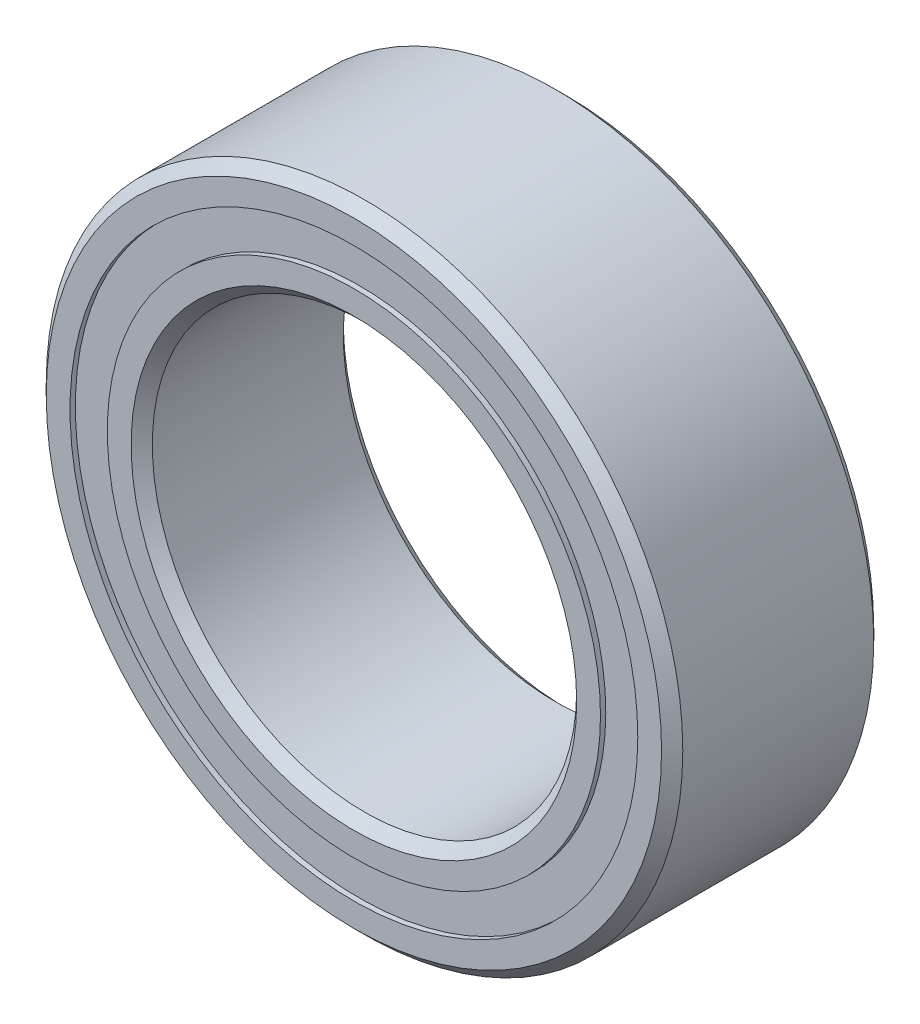
ISO-10303-21;
HEADER;
FILE_DESCRIPTION(('STEP AP214'),'2;1');
FILE_NAME('part.step','',(''),(''),'','','');
FILE_SCHEMA(('AUTOMOTIVE_DESIGN { 1 0 10303 214 1 1 1 1 }'));
ENDSEC;
DATA;
#1=APPLICATION_CONTEXT('core data for automotive mechanical design processes');
#2=APPLICATION_PROTOCOL_DEFINITION('international standard','automotive_design',2000,#1);
#3=PRODUCT_CONTEXT('',#1,'mechanical');
#4=PRODUCT('Part','Part','',(#3));
#5=PRODUCT_RELATED_PRODUCT_CATEGORY('part','',(#4));
#6=PRODUCT_DEFINITION_FORMATION('','',#4);
#7=PRODUCT_DEFINITION_CONTEXT('part definition',#1,'design');
#8=PRODUCT_DEFINITION('design','',#6,#7);
#9=PRODUCT_DEFINITION_SHAPE('','',#8);
#10=(LENGTH_UNIT() NAMED_UNIT(*) SI_UNIT(.MILLI.,.METRE.));
#11=(NAMED_UNIT(*) PLANE_ANGLE_UNIT() SI_UNIT($,.RADIAN.));
#12=(NAMED_UNIT(*) SI_UNIT($,.STERADIAN.) SOLID_ANGLE_UNIT());
#13=UNCERTAINTY_MEASURE_WITH_UNIT(LENGTH_MEASURE(1.E-05),#10,'distance_accuracy_value','');
#14=(GEOMETRIC_REPRESENTATION_CONTEXT(3) GLOBAL_UNCERTAINTY_ASSIGNED_CONTEXT((#13)) GLOBAL_UNIT_ASSIGNED_CONTEXT((#10,
#11,#12)) REPRESENTATION_CONTEXT('',''));
#15=CARTESIAN_POINT('',(0.,0.,0.));
#16=DIRECTION('',(0.,0.,1.));
#17=DIRECTION('',(1.,0.,0.));
#18=AXIS2_PLACEMENT_3D('',#15,#16,#17);
#19=CARTESIAN_POINT('',(1.984375,3.43703832126949,0.));
#20=DIRECTION('',(0.500000000000001,0.866025403784438,0.));
#21=DIRECTION('',(0.,0.,-1.));
#22=AXIS2_PLACEMENT_3D('',#19,#20,#21);
#23=SPHERICAL_SURFACE('',#22,0.758760243513404);
#24=CARTESIAN_POINT('',(2.36375512175671,4.09414396753376,0.));
#25=VERTEX_POINT('',#24);
#26=VERTEX_LOOP('',#25);
#27=FACE_BOUND('',#26,.T.);
#28=CARTESIAN_POINT('',(1.6049948782433,2.77993267500521,0.));
#29=VERTEX_POINT('',#28);
#30=VERTEX_LOOP('',#29);
#31=FACE_BOUND('',#30,.T.);
#32=ADVANCED_FACE('P0_F16',(#27,#31),#23,.T.);
#33=CLOSED_SHELL('',(#32));
#34=MANIFOLD_SOLID_BREP('P0_B1',#33);
#35=CARTESIAN_POINT('',(-3.96875,0.,0.));
#36=DIRECTION('',(-1.,0.,0.));
#37=DIRECTION('',(0.,0.,-1.));
#38=AXIS2_PLACEMENT_3D('',#35,#36,#37);
#39=SPHERICAL_SURFACE('',#38,0.758760243513404);
#40=CARTESIAN_POINT('',(-4.7275102435134,0.,0.));
#41=VERTEX_POINT('',#40);
#42=VERTEX_LOOP('',#41);
#43=FACE_BOUND('',#42,.T.);
#44=CARTESIAN_POINT('',(-3.2099897564866,0.,0.));
#45=VERTEX_POINT('',#44);
#46=VERTEX_LOOP('',#45);
#47=FACE_BOUND('',#46,.T.);
#48=ADVANCED_FACE('P1_F16',(#43,#47),#39,.T.);
#49=CLOSED_SHELL('',(#48));
#50=MANIFOLD_SOLID_BREP('P1_B1',#49);
#51=CARTESIAN_POINT('',(0.,0.,0.));
#52=DIRECTION('',(0.,0.,1.));
#53=DIRECTION('',(1.,0.,0.));
#54=AXIS2_PLACEMENT_3D('',#51,#52,#53);
#55=TOROIDAL_SURFACE('',#54,3.96875,0.758760243513403);
#56=CARTESIAN_POINT('',(0.,0.,0.705555555555556));
#57=DIRECTION('',(0.,0.,1.));
#58=DIRECTION('',(1.,0.,0.));
#59=AXIS2_PLACEMENT_3D('',#56,#57,#58);
#60=CIRCLE('',#59,3.68962912087912);
#61=CARTESIAN_POINT('',(3.68962912087912,0.,0.705555555555556));
#62=VERTEX_POINT('',#61);
#63=EDGE_CURVE('P2_E33',#62,#62,#60,.T.);
#64=ORIENTED_EDGE('',*,*,#63,.F.);
#65=EDGE_LOOP('',(#64));
#66=FACE_BOUND('',#65,.T.);
#67=CARTESIAN_POINT('',(0.,0.,-0.705555555555556));
#68=DIRECTION('',(0.,0.,1.));
#69=DIRECTION('',(1.,0.,0.));
#70=AXIS2_PLACEMENT_3D('',#67,#68,#69);
#71=CIRCLE('',#70,3.68962912087912);
#72=CARTESIAN_POINT('',(3.68962912087912,0.,-0.705555555555556));
#73=VERTEX_POINT('',#72);
#74=EDGE_CURVE('P2_E31',#73,#73,#71,.F.);
#75=ORIENTED_EDGE('',*,*,#74,.F.);
#76=EDGE_LOOP('',(#75));
#77=FACE_BOUND('',#76,.T.);
#78=ADVANCED_FACE('P2_F15',(#66,#77),#55,.F.);
#79=CARTESIAN_POINT('',(0.,0.,1.5875));
#80=DIRECTION('',(0.,0.,1.));
#81=DIRECTION('',(1.,0.,0.));
#82=AXIS2_PLACEMENT_3D('',#79,#80,#81);
#83=CYLINDRICAL_SURFACE('',#82,3.68962912087912);
#84=CARTESIAN_POINT('',(0.,0.,1.5875));
#85=DIRECTION('',(0.,0.,1.));
#86=DIRECTION('',(1.,0.,0.));
#87=AXIS2_PLACEMENT_3D('',#84,#85,#86);
#88=CIRCLE('',#87,3.68962912087912);
#89=CARTESIAN_POINT('',(3.68962912087912,0.,1.5875));
#90=VERTEX_POINT('',#89);
#91=EDGE_CURVE('P2_E19',#90,#90,#88,.F.);
#92=ORIENTED_EDGE('',*,*,#91,.T.);
#93=EDGE_LOOP('',(#92));
#94=FACE_BOUND('',#93,.T.);
#95=ORIENTED_EDGE('',*,*,#63,.T.);
#96=EDGE_LOOP('',(#95));
#97=FACE_BOUND('',#96,.T.);
#98=ADVANCED_FACE('P2_F49',(#94,#97),#83,.T.);
#99=CARTESIAN_POINT('',(0.,0.,1.5875));
#100=DIRECTION('',(0.,0.,1.));
#101=DIRECTION('',(1.,0.,0.));
#102=AXIS2_PLACEMENT_3D('',#99,#100,#101);
#103=CYLINDRICAL_SURFACE('',#102,3.68962912087912);
#104=ORIENTED_EDGE('',*,*,#74,.T.);
#105=EDGE_LOOP('',(#104));
#106=FACE_BOUND('',#105,.T.);
#107=CARTESIAN_POINT('',(0.,0.,-1.5875));
#108=DIRECTION('',(0.,0.,1.));
#109=DIRECTION('',(1.,0.,0.));
#110=AXIS2_PLACEMENT_3D('',#107,#108,#109);
#111=CIRCLE('',#110,3.68962912087912);
#112=CARTESIAN_POINT('',(3.68962912087912,0.,-1.5875));
#113=VERTEX_POINT('',#112);
#114=EDGE_CURVE('P2_E42',#113,#113,#111,.T.);
#115=ORIENTED_EDGE('',*,*,#114,.T.);
#116=EDGE_LOOP('',(#115));
#117=FACE_BOUND('',#116,.T.);
#118=ADVANCED_FACE('P2_F56',(#106,#117),#103,.T.);
#119=CARTESIAN_POINT('',(0.,3.68962912087912,1.5875));
#120=DIRECTION('',(0.,0.,-1.));
#121=DIRECTION('',(-1.,0.,0.));
#122=AXIS2_PLACEMENT_3D('',#119,#120,#121);
#123=PLANE('',#122);
#124=ORIENTED_EDGE('',*,*,#91,.F.);
#125=EDGE_LOOP('',(#124));
#126=FACE_BOUND('',#125,.T.);
#127=CARTESIAN_POINT('',(0.,0.,1.58749999997099));
#128=DIRECTION('',(0.,0.,1.));
#129=DIRECTION('',(1.,0.,0.));
#130=AXIS2_PLACEMENT_3D('',#127,#128,#129);
#131=CIRCLE('',#130,3.33374999996749);
#132=CARTESIAN_POINT('',(3.33374999996749,0.,1.58749999997099));
#133=VERTEX_POINT('',#132);
#134=EDGE_CURVE('P2_E40',#133,#133,#131,.F.);
#135=ORIENTED_EDGE('',*,*,#134,.T.);
#136=EDGE_LOOP('',(#135));
#137=FACE_BOUND('',#136,.T.);
#138=ADVANCED_FACE('P2_F52',(#126,#137),#123,.F.);
#139=CARTESIAN_POINT('',(0.,3.33375,-1.5875));
#140=DIRECTION('',(0.,0.,1.));
#141=DIRECTION('',(1.,0.,0.));
#142=AXIS2_PLACEMENT_3D('',#139,#140,#141);
#143=PLANE('',#142);
#144=CARTESIAN_POINT('',(0.,0.,-1.58749999997099));
#145=DIRECTION('',(0.,0.,-1.));
#146=DIRECTION('',(0.,1.,0.));
#147=AXIS2_PLACEMENT_3D('',#144,#145,#146);
#148=CIRCLE('',#147,3.33375000002434);
#149=CARTESIAN_POINT('',(0.,3.33375000002434,-1.58749999997099));
#150=VERTEX_POINT('',#149);
#151=EDGE_CURVE('P2_E28',#150,#150,#148,.F.);
#152=ORIENTED_EDGE('',*,*,#151,.T.);
#153=EDGE_LOOP('',(#152));
#154=FACE_BOUND('',#153,.T.);
#155=ORIENTED_EDGE('',*,*,#114,.F.);
#156=EDGE_LOOP('',(#155));
#157=FACE_BOUND('',#156,.T.);
#158=ADVANCED_FACE('P2_F55',(#154,#157),#143,.F.);
#159=CARTESIAN_POINT('',(0.,0.,1.58749999991414));
#160=DIRECTION('',(0.,0.,1.));
#161=DIRECTION('',(1.,0.,0.));
#162=AXIS2_PLACEMENT_3D('',#159,#160,#161);
#163=CONICAL_SURFACE('',#162,3.33374999991065,0.785398163397448);
#164=ORIENTED_EDGE('',*,*,#134,.F.);
#165=EDGE_LOOP('',(#164));
#166=FACE_BOUND('',#165,.T.);
#167=CARTESIAN_POINT('',(0.,0.,1.42875));
#168=DIRECTION('',(0.,0.,1.));
#169=DIRECTION('',(1.,0.,0.));
#170=AXIS2_PLACEMENT_3D('',#167,#168,#169);
#171=CIRCLE('',#170,3.175);
#172=CARTESIAN_POINT('',(3.175,0.,1.42875));
#173=VERTEX_POINT('',#172);
#174=EDGE_CURVE('P2_E23',#173,#173,#171,.F.);
#175=ORIENTED_EDGE('',*,*,#174,.T.);
#176=EDGE_LOOP('',(#175));
#177=FACE_BOUND('',#176,.T.);
#178=ADVANCED_FACE('P2_F60',(#166,#177),#163,.F.);
#179=CARTESIAN_POINT('',(0.,0.,-1.58749999997099));
#180=DIRECTION('',(0.,0.,-1.));
#181=DIRECTION('',(0.,1.,0.));
#182=AXIS2_PLACEMENT_3D('',#179,#180,#181);
#183=CONICAL_SURFACE('',#182,3.33375000002434,0.785398163397448);
#184=CARTESIAN_POINT('',(0.,0.,-1.42875));
#185=DIRECTION('',(0.,0.,1.));
#186=DIRECTION('',(1.,0.,0.));
#187=AXIS2_PLACEMENT_3D('',#184,#185,#186);
#188=CIRCLE('',#187,3.175);
#189=CARTESIAN_POINT('',(3.175,0.,-1.42875));
#190=VERTEX_POINT('',#189);
#191=EDGE_CURVE('P2_E10',#190,#190,#188,.T.);
#192=ORIENTED_EDGE('',*,*,#191,.T.);
#193=EDGE_LOOP('',(#192));
#194=FACE_BOUND('',#193,.T.);
#195=ORIENTED_EDGE('',*,*,#151,.F.);
#196=EDGE_LOOP('',(#195));
#197=FACE_BOUND('',#196,.T.);
#198=ADVANCED_FACE('P2_F63',(#194,#197),#183,.F.);
#199=CARTESIAN_POINT('',(0.,0.,1.5875));
#200=DIRECTION('',(0.,0.,1.));
#201=DIRECTION('',(1.,0.,0.));
#202=AXIS2_PLACEMENT_3D('',#199,#200,#201);
#203=CYLINDRICAL_SURFACE('',#202,3.175);
#204=ORIENTED_EDGE('',*,*,#174,.F.);
#205=EDGE_LOOP('',(#204));
#206=FACE_BOUND('',#205,.T.);
#207=ORIENTED_EDGE('',*,*,#191,.F.);
#208=EDGE_LOOP('',(#207));
#209=FACE_BOUND('',#208,.T.);
#210=ADVANCED_FACE('P2_F67',(#206,#209),#203,.F.);
#211=CLOSED_SHELL('',(#78,#98,#118,#138,#158,#178,#198,#210));
#212=MANIFOLD_SOLID_BREP('P2_B1',#211);
#213=CARTESIAN_POINT('',(3.4370383212695,1.98437499999999,0.));
#214=DIRECTION('',(0.86602540378444,0.499999999999998,0.));
#215=DIRECTION('',(0.,0.,-1.));
#216=AXIS2_PLACEMENT_3D('',#213,#214,#215);
#217=SPHERICAL_SURFACE('',#216,0.758760243513404);
#218=CARTESIAN_POINT('',(4.09414396753377,2.36375512175669,0.));
#219=VERTEX_POINT('',#218);
#220=VERTEX_LOOP('',#219);
#221=FACE_BOUND('',#220,.T.);
#222=CARTESIAN_POINT('',(2.77993267500522,1.60499487824329,0.));
#223=VERTEX_POINT('',#222);
#224=VERTEX_LOOP('',#223);
#225=FACE_BOUND('',#224,.T.);
#226=ADVANCED_FACE('P3_F16',(#221,#225),#217,.T.);
#227=CLOSED_SHELL('',(#226));
#228=MANIFOLD_SOLID_BREP('P3_B1',#227);
#229=CARTESIAN_POINT('',(3.96875,0.,0.));
#230=DIRECTION('',(1.,0.,0.));
#231=DIRECTION('',(0.,0.,-1.));
#232=AXIS2_PLACEMENT_3D('',#229,#230,#231);
#233=SPHERICAL_SURFACE('',#232,0.758760243513404);
#234=CARTESIAN_POINT('',(3.2099897564866,0.,0.));
#235=VERTEX_POINT('',#234);
#236=VERTEX_LOOP('',#235);
#237=FACE_BOUND('',#236,.T.);
#238=CARTESIAN_POINT('',(4.7275102435134,0.,0.));
#239=VERTEX_POINT('',#238);
#240=VERTEX_LOOP('',#239);
#241=FACE_BOUND('',#240,.T.);
#242=ADVANCED_FACE('P4_F16',(#237,#241),#233,.T.);
#243=CLOSED_SHELL('',(#242));
#244=MANIFOLD_SOLID_BREP('P4_B1',#243);
#245=CARTESIAN_POINT('',(1.98437499999998,-3.4370383212695,0.));
#246=DIRECTION('',(0.499999999999995,-0.866025403784442,0.));
#247=DIRECTION('',(0.,0.,-1.));
#248=AXIS2_PLACEMENT_3D('',#245,#246,#247);
#249=SPHERICAL_SURFACE('',#248,0.758760243513404);
#250=CARTESIAN_POINT('',(2.36375512175668,-4.09414396753378,0.));
#251=VERTEX_POINT('',#250);
#252=VERTEX_LOOP('',#251);
#253=FACE_BOUND('',#252,.T.);
#254=CARTESIAN_POINT('',(1.60499487824328,-2.77993267500523,0.));
#255=VERTEX_POINT('',#254);
#256=VERTEX_LOOP('',#255);
#257=FACE_BOUND('',#256,.T.);
#258=ADVANCED_FACE('P5_F16',(#253,#257),#249,.T.);
#259=CLOSED_SHELL('',(#258));
#260=MANIFOLD_SOLID_BREP('P5_B1',#259);
#261=CARTESIAN_POINT('',(0.,0.,0.));
#262=DIRECTION('',(0.,0.,1.));
#263=DIRECTION('',(1.,0.,0.));
#264=AXIS2_PLACEMENT_3D('',#261,#262,#263);
#265=TOROIDAL_SURFACE('',#264,3.96875,0.758760243513404);
#266=CARTESIAN_POINT('',(0.,0.,-0.705555555555556));
#267=DIRECTION('',(0.,0.,1.));
#268=DIRECTION('',(1.,0.,0.));
#269=AXIS2_PLACEMENT_3D('',#266,#267,#268);
#270=CIRCLE('',#269,4.24787087912088);
#271=CARTESIAN_POINT('',(4.24787087912088,0.,-0.705555555555556));
#272=VERTEX_POINT('',#271);
#273=EDGE_CURVE('P6_E33',#272,#272,#270,.F.);
#274=ORIENTED_EDGE('',*,*,#273,.T.);
#275=EDGE_LOOP('',(#274));
#276=FACE_BOUND('',#275,.T.);
#277=CARTESIAN_POINT('',(0.,0.,0.705555555555555));
#278=DIRECTION('',(0.,0.,1.));
#279=DIRECTION('',(1.,0.,0.));
#280=AXIS2_PLACEMENT_3D('',#277,#278,#279);
#281=CIRCLE('',#280,4.24787087912088);
#282=CARTESIAN_POINT('',(4.24787087912088,0.,0.705555555555555));
#283=VERTEX_POINT('',#282);
#284=EDGE_CURVE('P6_E31',#283,#283,#281,.T.);
#285=ORIENTED_EDGE('',*,*,#284,.T.);
#286=EDGE_LOOP('',(#285));
#287=FACE_BOUND('',#286,.T.);
#288=ADVANCED_FACE('P6_F15',(#276,#287),#265,.F.);
#289=CARTESIAN_POINT('',(0.,0.,1.5875));
#290=DIRECTION('',(0.,0.,1.));
#291=DIRECTION('',(1.,0.,0.));
#292=AXIS2_PLACEMENT_3D('',#289,#290,#291);
#293=CYLINDRICAL_SURFACE('',#292,4.24787087912088);
#294=CARTESIAN_POINT('',(0.,0.,-1.5875));
#295=DIRECTION('',(0.,0.,1.));
#296=DIRECTION('',(1.,0.,0.));
#297=AXIS2_PLACEMENT_3D('',#294,#295,#296);
#298=CIRCLE('',#297,4.24787087912088);
#299=CARTESIAN_POINT('',(4.24787087912088,0.,-1.5875));
#300=VERTEX_POINT('',#299);
#301=EDGE_CURVE('P6_E19',#300,#300,#298,.F.);
#302=ORIENTED_EDGE('',*,*,#301,.T.);
#303=EDGE_LOOP('',(#302));
#304=FACE_BOUND('',#303,.T.);
#305=ORIENTED_EDGE('',*,*,#273,.F.);
#306=EDGE_LOOP('',(#305));
#307=FACE_BOUND('',#306,.T.);
#308=ADVANCED_FACE('P6_F49',(#304,#307),#293,.F.);
#309=CARTESIAN_POINT('',(0.,0.,1.5875));
#310=DIRECTION('',(0.,0.,1.));
#311=DIRECTION('',(1.,0.,0.));
#312=AXIS2_PLACEMENT_3D('',#309,#310,#311);
#313=CYLINDRICAL_SURFACE('',#312,4.24787087912088);
#314=ORIENTED_EDGE('',*,*,#284,.F.);
#315=EDGE_LOOP('',(#314));
#316=FACE_BOUND('',#315,.T.);
#317=CARTESIAN_POINT('',(0.,0.,1.5875));
#318=DIRECTION('',(0.,0.,1.));
#319=DIRECTION('',(1.,0.,0.));
#320=AXIS2_PLACEMENT_3D('',#317,#318,#319);
#321=CIRCLE('',#320,4.24787087912088);
#322=CARTESIAN_POINT('',(4.24787087912088,0.,1.5875));
#323=VERTEX_POINT('',#322);
#324=EDGE_CURVE('P6_E42',#323,#323,#321,.T.);
#325=ORIENTED_EDGE('',*,*,#324,.T.);
#326=EDGE_LOOP('',(#325));
#327=FACE_BOUND('',#326,.T.);
#328=ADVANCED_FACE('P6_F56',(#316,#327),#313,.F.);
#329=CARTESIAN_POINT('',(0.,4.60375,-1.5875));
#330=DIRECTION('',(0.,0.,1.));
#331=DIRECTION('',(1.,0.,0.));
#332=AXIS2_PLACEMENT_3D('',#329,#330,#331);
#333=PLANE('',#332);
#334=ORIENTED_EDGE('',*,*,#301,.F.);
#335=EDGE_LOOP('',(#334));
#336=FACE_BOUND('',#335,.T.);
#337=CARTESIAN_POINT('',(0.,0.,-1.58750000002783));
#338=DIRECTION('',(0.,0.,1.));
#339=DIRECTION('',(1.,0.,0.));
#340=AXIS2_PLACEMENT_3D('',#337,#338,#339);
#341=CIRCLE('',#340,4.60375000000113);
#342=CARTESIAN_POINT('',(4.60375000000113,0.,-1.58750000002783));
#343=VERTEX_POINT('',#342);
#344=EDGE_CURVE('P6_E40',#343,#343,#341,.T.);
#345=ORIENTED_EDGE('',*,*,#344,.F.);
#346=EDGE_LOOP('',(#345));
#347=FACE_BOUND('',#346,.T.);
#348=ADVANCED_FACE('P6_F52',(#336,#347),#333,.F.);
#349=CARTESIAN_POINT('',(0.,4.60375,1.5875));
#350=DIRECTION('',(0.,0.,-1.));
#351=DIRECTION('',(-1.,0.,0.));
#352=AXIS2_PLACEMENT_3D('',#349,#350,#351);
#353=PLANE('',#352);
#354=CARTESIAN_POINT('',(0.,0.,1.58750000008467));
#355=DIRECTION('',(0.,0.,-1.));
#356=DIRECTION('',(-1.,0.,0.));
#357=AXIS2_PLACEMENT_3D('',#354,#355,#356);
#358=CIRCLE('',#357,4.60375000000113);
#359=CARTESIAN_POINT('',(-4.60375000000113,0.,1.58750000008467));
#360=VERTEX_POINT('',#359);
#361=EDGE_CURVE('P6_E28',#360,#360,#358,.T.);
#362=ORIENTED_EDGE('',*,*,#361,.F.);
#363=EDGE_LOOP('',(#362));
#364=FACE_BOUND('',#363,.T.);
#365=ORIENTED_EDGE('',*,*,#324,.F.);
#366=EDGE_LOOP('',(#365));
#367=FACE_BOUND('',#366,.T.);
#368=ADVANCED_FACE('P6_F55',(#364,#367),#353,.F.);
#369=CARTESIAN_POINT('',(0.,0.,-1.42874999994547));
#370=DIRECTION('',(0.,0.,1.));
#371=DIRECTION('',(1.,0.,0.));
#372=AXIS2_PLACEMENT_3D('',#369,#370,#371);
#373=CONICAL_SURFACE('',#372,4.76250000002665,0.785398163218414);
#374=CARTESIAN_POINT('',(0.,0.,-1.42875));
#375=DIRECTION('',(0.,0.,1.));
#376=DIRECTION('',(1.,0.,0.));
#377=AXIS2_PLACEMENT_3D('',#374,#375,#376);
#378=CIRCLE('',#377,4.7625);
#379=CARTESIAN_POINT('',(4.7625,0.,-1.42875));
#380=VERTEX_POINT('',#379);
#381=EDGE_CURVE('P6_E23',#380,#380,#378,.T.);
#382=ORIENTED_EDGE('',*,*,#381,.F.);
#383=EDGE_LOOP('',(#382));
#384=FACE_BOUND('',#383,.T.);
#385=ORIENTED_EDGE('',*,*,#344,.T.);
#386=EDGE_LOOP('',(#385));
#387=FACE_BOUND('',#386,.T.);
#388=ADVANCED_FACE('P6_F60',(#384,#387),#373,.T.);
#389=CARTESIAN_POINT('',(0.,0.,1.42875000005915));
#390=DIRECTION('',(0.,0.,-1.));
#391=DIRECTION('',(-1.,0.,0.));
#392=AXIS2_PLACEMENT_3D('',#389,#390,#391);
#393=CONICAL_SURFACE('',#392,4.7624999999698,0.785398163218414);
#394=CARTESIAN_POINT('',(0.,0.,1.42875));
#395=DIRECTION('',(0.,0.,1.));
#396=DIRECTION('',(1.,0.,0.));
#397=AXIS2_PLACEMENT_3D('',#394,#395,#396);
#398=CIRCLE('',#397,4.7625);
#399=CARTESIAN_POINT('',(4.7625,0.,1.42875));
#400=VERTEX_POINT('',#399);
#401=EDGE_CURVE('P6_E10',#400,#400,#398,.F.);
#402=ORIENTED_EDGE('',*,*,#401,.F.);
#403=EDGE_LOOP('',(#402));
#404=FACE_BOUND('',#403,.T.);
#405=ORIENTED_EDGE('',*,*,#361,.T.);
#406=EDGE_LOOP('',(#405));
#407=FACE_BOUND('',#406,.T.);
#408=ADVANCED_FACE('P6_F62',(#404,#407),#393,.T.);
#409=CARTESIAN_POINT('',(0.,0.,1.5875));
#410=DIRECTION('',(0.,0.,1.));
#411=DIRECTION('',(1.,0.,0.));
#412=AXIS2_PLACEMENT_3D('',#409,#410,#411);
#413=CYLINDRICAL_SURFACE('',#412,4.7625);
#414=ORIENTED_EDGE('',*,*,#401,.T.);
#415=EDGE_LOOP('',(#414));
#416=FACE_BOUND('',#415,.T.);
#417=ORIENTED_EDGE('',*,*,#381,.T.);
#418=EDGE_LOOP('',(#417));
#419=FACE_BOUND('',#418,.T.);
#420=ADVANCED_FACE('P6_F70',(#416,#419),#413,.T.);
#421=CLOSED_SHELL('',(#288,#308,#328,#348,#368,#388,#408,#420));
#422=MANIFOLD_SOLID_BREP('P6_B1',#421);
#423=CARTESIAN_POINT('',(3.43703832126948,-1.98437500000002,0.));
#424=DIRECTION('',(0.866025403784437,-0.500000000000004,0.));
#425=DIRECTION('',(0.,0.,-1.));
#426=AXIS2_PLACEMENT_3D('',#423,#424,#425);
#427=SPHERICAL_SURFACE('',#426,0.758760243513404);
#428=CARTESIAN_POINT('',(4.09414396753376,-2.36375512175672,0.));
#429=VERTEX_POINT('',#428);
#430=VERTEX_LOOP('',#429);
#431=FACE_BOUND('',#430,.T.);
#432=CARTESIAN_POINT('',(2.77993267500521,-1.60499487824331,0.));
#433=VERTEX_POINT('',#432);
#434=VERTEX_LOOP('',#433);
#435=FACE_BOUND('',#434,.T.);
#436=ADVANCED_FACE('P7_F16',(#431,#435),#427,.T.);
#437=CLOSED_SHELL('',(#436));
#438=MANIFOLD_SOLID_BREP('P7_B1',#437);
#439=CARTESIAN_POINT('',(-1.98437499999996,3.43703832126952,0.));
#440=DIRECTION('',(-0.499999999999989,0.866025403784445,0.));
#441=DIRECTION('',(0.,0.,-1.));
#442=AXIS2_PLACEMENT_3D('',#439,#440,#441);
#443=SPHERICAL_SURFACE('',#442,0.758760243513404);
#444=CARTESIAN_POINT('',(-2.36375512175665,4.0941439675338,0.));
#445=VERTEX_POINT('',#444);
#446=VERTEX_LOOP('',#445);
#447=FACE_BOUND('',#446,.T.);
#448=CARTESIAN_POINT('',(-1.60499487824326,2.77993267500524,0.));
#449=VERTEX_POINT('',#448);
#450=VERTEX_LOOP('',#449);
#451=FACE_BOUND('',#450,.T.);
#452=ADVANCED_FACE('P8_F16',(#447,#451),#443,.T.);
#453=CLOSED_SHELL('',(#452));
#454=MANIFOLD_SOLID_BREP('P8_B1',#453);
#455=CARTESIAN_POINT('',(0.,-3.96875,0.));
#456=DIRECTION('',(0.,-1.,0.));
#457=DIRECTION('',(0.,0.,-1.));
#458=AXIS2_PLACEMENT_3D('',#455,#456,#457);
#459=SPHERICAL_SURFACE('',#458,0.758760243513404);
#460=CARTESIAN_POINT('',(0.,-3.2099897564866,0.));
#461=VERTEX_POINT('',#460);
#462=VERTEX_LOOP('',#461);
#463=FACE_BOUND('',#462,.T.);
#464=CARTESIAN_POINT('',(0.,-4.7275102435134,0.));
#465=VERTEX_POINT('',#464);
#466=VERTEX_LOOP('',#465);
#467=FACE_BOUND('',#466,.T.);
#468=ADVANCED_FACE('P9_F16',(#463,#467),#459,.T.);
#469=CLOSED_SHELL('',(#468));
#470=MANIFOLD_SOLID_BREP('P9_B1',#469);
#471=CARTESIAN_POINT('',(-1.98437500000003,-3.43703832126947,0.));
#472=DIRECTION('',(-0.500000000000007,-0.866025403784435,0.));
#473=DIRECTION('',(0.,0.,-1.));
#474=AXIS2_PLACEMENT_3D('',#471,#472,#473);
#475=SPHERICAL_SURFACE('',#474,0.758760243513404);
#476=CARTESIAN_POINT('',(-1.60499487824332,-2.7799326750052,0.));
#477=VERTEX_POINT('',#476);
#478=VERTEX_LOOP('',#477);
#479=FACE_BOUND('',#478,.T.);
#480=CARTESIAN_POINT('',(-2.36375512175674,-4.09414396753375,0.));
#481=VERTEX_POINT('',#480);
#482=VERTEX_LOOP('',#481);
#483=FACE_BOUND('',#482,.T.);
#484=ADVANCED_FACE('P10_F16',(#479,#483),#475,.T.);
#485=CLOSED_SHELL('',(#484));
#486=MANIFOLD_SOLID_BREP('P10_B1',#485);
#487=CARTESIAN_POINT('',(0.,4.24787087912088,0.758760243513404));
#488=DIRECTION('',(0.,0.,1.));
#489=DIRECTION('',(1.,0.,0.));
#490=AXIS2_PLACEMENT_3D('',#487,#488,#489);
#491=PLANE('',#490);
#492=CARTESIAN_POINT('',(0.,0.,0.758760243513404));
#493=DIRECTION('',(0.,0.,1.));
#494=DIRECTION('',(1.,0.,0.));
#495=AXIS2_PLACEMENT_3D('',#492,#493,#494);
#496=CIRCLE('',#495,3.68962912087912);
#497=CARTESIAN_POINT('',(3.68962912087912,0.,0.758760243513404));
#498=VERTEX_POINT('',#497);
#499=EDGE_CURVE('P11_E18',#498,#498,#496,.T.);
#500=ORIENTED_EDGE('',*,*,#499,.T.);
#501=EDGE_LOOP('',(#500));
#502=FACE_BOUND('',#501,.T.);
#503=CARTESIAN_POINT('',(0.,0.,0.758760243513404));
#504=DIRECTION('',(0.,0.,1.));
#505=DIRECTION('',(1.,0.,0.));
#506=AXIS2_PLACEMENT_3D('',#503,#504,#505);
#507=CIRCLE('',#506,4.24787087912088);
#508=CARTESIAN_POINT('',(4.24787087912088,0.,0.758760243513404));
#509=VERTEX_POINT('',#508);
#510=EDGE_CURVE('P11_E27',#509,#509,#507,.T.);
#511=ORIENTED_EDGE('',*,*,#510,.F.);
#512=EDGE_LOOP('',(#511));
#513=FACE_BOUND('',#512,.T.);
#514=ADVANCED_FACE('P11_F15',(#502,#513),#491,.F.);
#515=CARTESIAN_POINT('',(0.,0.,1.5875));
#516=DIRECTION('',(0.,0.,1.));
#517=DIRECTION('',(1.,0.,0.));
#518=AXIS2_PLACEMENT_3D('',#515,#516,#517);
#519=CYLINDRICAL_SURFACE('',#518,3.68962912087912);
#520=ORIENTED_EDGE('',*,*,#499,.F.);
#521=EDGE_LOOP('',(#520));
#522=FACE_BOUND('',#521,.T.);
#523=CARTESIAN_POINT('',(0.,0.,1.508125));
#524=DIRECTION('',(0.,0.,1.));
#525=DIRECTION('',(1.,0.,0.));
#526=AXIS2_PLACEMENT_3D('',#523,#524,#525);
#527=CIRCLE('',#526,3.68962912087912);
#528=CARTESIAN_POINT('',(3.68962912087912,0.,1.508125));
#529=VERTEX_POINT('',#528);
#530=EDGE_CURVE('P11_E22',#529,#529,#527,.T.);
#531=ORIENTED_EDGE('',*,*,#530,.T.);
#532=EDGE_LOOP('',(#531));
#533=FACE_BOUND('',#532,.T.);
#534=ADVANCED_FACE('P11_F37',(#522,#533),#519,.F.);
#535=CARTESIAN_POINT('',(0.,0.,1.5875));
#536=DIRECTION('',(0.,0.,1.));
#537=DIRECTION('',(1.,0.,0.));
#538=AXIS2_PLACEMENT_3D('',#535,#536,#537);
#539=CYLINDRICAL_SURFACE('',#538,4.24787087912088);
#540=CARTESIAN_POINT('',(0.,0.,1.508125));
#541=DIRECTION('',(0.,0.,1.));
#542=DIRECTION('',(1.,0.,0.));
#543=AXIS2_PLACEMENT_3D('',#540,#541,#542);
#544=CIRCLE('',#543,4.24787087912088);
#545=CARTESIAN_POINT('',(4.24787087912088,0.,1.508125));
#546=VERTEX_POINT('',#545);
#547=EDGE_CURVE('P11_E10',#546,#546,#544,.F.);
#548=ORIENTED_EDGE('',*,*,#547,.T.);
#549=EDGE_LOOP('',(#548));
#550=FACE_BOUND('',#549,.T.);
#551=ORIENTED_EDGE('',*,*,#510,.T.);
#552=EDGE_LOOP('',(#551));
#553=FACE_BOUND('',#552,.T.);
#554=ADVANCED_FACE('P11_F40',(#550,#553),#539,.T.);
#555=CARTESIAN_POINT('',(0.,4.24787087912088,1.508125));
#556=DIRECTION('',(0.,0.,-1.));
#557=DIRECTION('',(-1.,0.,0.));
#558=AXIS2_PLACEMENT_3D('',#555,#556,#557);
#559=PLANE('',#558);
#560=ORIENTED_EDGE('',*,*,#547,.F.);
#561=EDGE_LOOP('',(#560));
#562=FACE_BOUND('',#561,.T.);
#563=ORIENTED_EDGE('',*,*,#530,.F.);
#564=EDGE_LOOP('',(#563));
#565=FACE_BOUND('',#564,.T.);
#566=ADVANCED_FACE('P11_F43',(#562,#565),#559,.F.);
#567=CLOSED_SHELL('',(#514,#534,#554,#566));
#568=MANIFOLD_SOLID_BREP('P11_B1',#567);
#569=CARTESIAN_POINT('',(0.,3.96875,0.));
#570=DIRECTION('',(0.,1.,0.));
#571=DIRECTION('',(0.,0.,-1.));
#572=AXIS2_PLACEMENT_3D('',#569,#570,#571);
#573=SPHERICAL_SURFACE('',#572,0.758760243513404);
#574=CARTESIAN_POINT('',(0.,3.2099897564866,0.));
#575=VERTEX_POINT('',#574);
#576=VERTEX_LOOP('',#575);
#577=FACE_BOUND('',#576,.T.);
#578=CARTESIAN_POINT('',(0.,4.7275102435134,0.));
#579=VERTEX_POINT('',#578);
#580=VERTEX_LOOP('',#579);
#581=FACE_BOUND('',#580,.T.);
#582=ADVANCED_FACE('P12_F16',(#577,#581),#573,.T.);
#583=CLOSED_SHELL('',(#582));
#584=MANIFOLD_SOLID_BREP('P12_B1',#583);
#585=CARTESIAN_POINT('',(0.,4.24787087912088,-1.508125));
#586=DIRECTION('',(0.,0.,1.));
#587=DIRECTION('',(1.,0.,0.));
#588=AXIS2_PLACEMENT_3D('',#585,#586,#587);
#589=PLANE('',#588);
#590=CARTESIAN_POINT('',(0.,0.,-1.508125));
#591=DIRECTION('',(0.,0.,1.));
#592=DIRECTION('',(1.,0.,0.));
#593=AXIS2_PLACEMENT_3D('',#590,#591,#592);
#594=CIRCLE('',#593,3.68962912087912);
#595=CARTESIAN_POINT('',(3.68962912087912,0.,-1.508125));
#596=VERTEX_POINT('',#595);
#597=EDGE_CURVE('P13_E18',#596,#596,#594,.T.);
#598=ORIENTED_EDGE('',*,*,#597,.T.);
#599=EDGE_LOOP('',(#598));
#600=FACE_BOUND('',#599,.T.);
#601=CARTESIAN_POINT('',(0.,0.,-1.508125));
#602=DIRECTION('',(0.,0.,1.));
#603=DIRECTION('',(1.,0.,0.));
#604=AXIS2_PLACEMENT_3D('',#601,#602,#603);
#605=CIRCLE('',#604,4.24787087912088);
#606=CARTESIAN_POINT('',(4.24787087912088,0.,-1.508125));
#607=VERTEX_POINT('',#606);
#608=EDGE_CURVE('P13_E27',#607,#607,#605,.T.);
#609=ORIENTED_EDGE('',*,*,#608,.F.);
#610=EDGE_LOOP('',(#609));
#611=FACE_BOUND('',#610,.T.);
#612=ADVANCED_FACE('P13_F15',(#600,#611),#589,.F.);
#613=CARTESIAN_POINT('',(0.,0.,1.5875));
#614=DIRECTION('',(0.,0.,1.));
#615=DIRECTION('',(1.,0.,0.));
#616=AXIS2_PLACEMENT_3D('',#613,#614,#615);
#617=CYLINDRICAL_SURFACE('',#616,3.68962912087912);
#618=ORIENTED_EDGE('',*,*,#597,.F.);
#619=EDGE_LOOP('',(#618));
#620=FACE_BOUND('',#619,.T.);
#621=CARTESIAN_POINT('',(0.,0.,-0.758760243513405));
#622=DIRECTION('',(0.,0.,1.));
#623=DIRECTION('',(1.,0.,0.));
#624=AXIS2_PLACEMENT_3D('',#621,#622,#623);
#625=CIRCLE('',#624,3.68962912087912);
#626=CARTESIAN_POINT('',(3.68962912087912,0.,-0.758760243513405));
#627=VERTEX_POINT('',#626);
#628=EDGE_CURVE('P13_E22',#627,#627,#625,.T.);
#629=ORIENTED_EDGE('',*,*,#628,.T.);
#630=EDGE_LOOP('',(#629));
#631=FACE_BOUND('',#630,.T.);
#632=ADVANCED_FACE('P13_F37',(#620,#631),#617,.F.);
#633=CARTESIAN_POINT('',(0.,0.,1.5875));
#634=DIRECTION('',(0.,0.,1.));
#635=DIRECTION('',(1.,0.,0.));
#636=AXIS2_PLACEMENT_3D('',#633,#634,#635);
#637=CYLINDRICAL_SURFACE('',#636,4.24787087912088);
#638=CARTESIAN_POINT('',(0.,0.,-0.758760243513404));
#639=DIRECTION('',(0.,0.,1.));
#640=DIRECTION('',(1.,0.,0.));
#641=AXIS2_PLACEMENT_3D('',#638,#639,#640);
#642=CIRCLE('',#641,4.24787087912088);
#643=CARTESIAN_POINT('',(4.24787087912088,0.,-0.758760243513404));
#644=VERTEX_POINT('',#643);
#645=EDGE_CURVE('P13_E10',#644,#644,#642,.F.);
#646=ORIENTED_EDGE('',*,*,#645,.T.);
#647=EDGE_LOOP('',(#646));
#648=FACE_BOUND('',#647,.T.);
#649=ORIENTED_EDGE('',*,*,#608,.T.);
#650=EDGE_LOOP('',(#649));
#651=FACE_BOUND('',#650,.T.);
#652=ADVANCED_FACE('P13_F40',(#648,#651),#637,.T.);
#653=CARTESIAN_POINT('',(0.,4.24787087912088,-0.758760243513404));
#654=DIRECTION('',(0.,0.,-1.));
#655=DIRECTION('',(-1.,0.,0.));
#656=AXIS2_PLACEMENT_3D('',#653,#654,#655);
#657=PLANE('',#656);
#658=ORIENTED_EDGE('',*,*,#645,.F.);
#659=EDGE_LOOP('',(#658));
#660=FACE_BOUND('',#659,.T.);
#661=ORIENTED_EDGE('',*,*,#628,.F.);
#662=EDGE_LOOP('',(#661));
#663=FACE_BOUND('',#662,.T.);
#664=ADVANCED_FACE('P13_F43',(#660,#663),#657,.F.);
#665=CLOSED_SHELL('',(#612,#632,#652,#664));
#666=MANIFOLD_SOLID_BREP('P13_B1',#665);
#667=CARTESIAN_POINT('',(-3.43703832126951,-1.98437499999997,0.));
#668=DIRECTION('',(-0.866025403784443,-0.499999999999992,0.));
#669=DIRECTION('',(0.,0.,-1.));
#670=AXIS2_PLACEMENT_3D('',#667,#668,#669);
#671=SPHERICAL_SURFACE('',#670,0.758760243513404);
#672=CARTESIAN_POINT('',(-4.09414396753379,-2.36375512175666,0.));
#673=VERTEX_POINT('',#672);
#674=VERTEX_LOOP('',#673);
#675=FACE_BOUND('',#674,.T.);
#676=CARTESIAN_POINT('',(-2.77993267500523,-1.60499487824327,0.));
#677=VERTEX_POINT('',#676);
#678=VERTEX_LOOP('',#677);
#679=FACE_BOUND('',#678,.T.);
#680=ADVANCED_FACE('P14_F16',(#675,#679),#671,.T.);
#681=CLOSED_SHELL('',(#680));
#682=MANIFOLD_SOLID_BREP('P14_B1',#681);
#683=CARTESIAN_POINT('',(-3.43703832126947,1.98437500000004,0.));
#684=DIRECTION('',(-0.866025403784433,0.50000000000001,0.));
#685=DIRECTION('',(0.,0.,-1.));
#686=AXIS2_PLACEMENT_3D('',#683,#684,#685);
#687=SPHERICAL_SURFACE('',#686,0.758760243513404);
#688=CARTESIAN_POINT('',(-2.7799326750052,1.60499487824333,0.));
#689=VERTEX_POINT('',#688);
#690=VERTEX_LOOP('',#689);
#691=FACE_BOUND('',#690,.T.);
#692=CARTESIAN_POINT('',(-4.09414396753374,2.36375512175675,0.));
#693=VERTEX_POINT('',#692);
#694=VERTEX_LOOP('',#693);
#695=FACE_BOUND('',#694,.T.);
#696=ADVANCED_FACE('P15_F16',(#691,#695),#687,.T.);
#697=CLOSED_SHELL('',(#696));
#698=MANIFOLD_SOLID_BREP('P15_B1',#697);
#699=ADVANCED_BREP_SHAPE_REPRESENTATION('',(#18,#34,#50,#212,#228,#244,#260,#422,#438,#454,#470,
#486,#568,#584,#666,#682,#698),#14);
#700=SHAPE_DEFINITION_REPRESENTATION(#9,#699);
ENDSEC;
END-ISO-10303-21;
